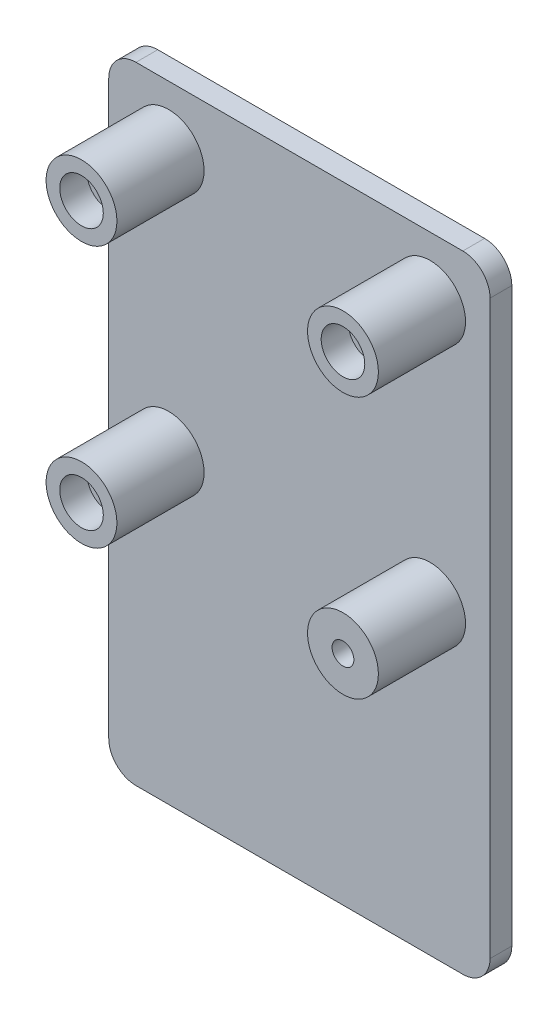
ISO-10303-21;
HEADER;
FILE_DESCRIPTION(('STEP AP214'),'2;1');
FILE_NAME('part.step','',(''),(''),'','','');
FILE_SCHEMA(('AUTOMOTIVE_DESIGN { 1 0 10303 214 1 1 1 1 }'));
ENDSEC;
DATA;
#1=APPLICATION_CONTEXT('core data for automotive mechanical design processes');
#2=APPLICATION_PROTOCOL_DEFINITION('international standard','automotive_design',2000,#1);
#3=PRODUCT_CONTEXT('',#1,'mechanical');
#4=PRODUCT('Part','Part','',(#3));
#5=PRODUCT_RELATED_PRODUCT_CATEGORY('part','',(#4));
#6=PRODUCT_DEFINITION_FORMATION('','',#4);
#7=PRODUCT_DEFINITION_CONTEXT('part definition',#1,'design');
#8=PRODUCT_DEFINITION('design','',#6,#7);
#9=PRODUCT_DEFINITION_SHAPE('','',#8);
#10=(LENGTH_UNIT() NAMED_UNIT(*) SI_UNIT(.MILLI.,.METRE.));
#11=(NAMED_UNIT(*) PLANE_ANGLE_UNIT() SI_UNIT($,.RADIAN.));
#12=(NAMED_UNIT(*) SI_UNIT($,.STERADIAN.) SOLID_ANGLE_UNIT());
#13=UNCERTAINTY_MEASURE_WITH_UNIT(LENGTH_MEASURE(1.E-05),#10,'distance_accuracy_value','');
#14=(GEOMETRIC_REPRESENTATION_CONTEXT(3) GLOBAL_UNCERTAINTY_ASSIGNED_CONTEXT((#13)) GLOBAL_UNIT_ASSIGNED_CONTEXT((#10,
#11,#12)) REPRESENTATION_CONTEXT('',''));
#15=CARTESIAN_POINT('',(0.,0.,0.));
#16=DIRECTION('',(0.,0.,1.));
#17=DIRECTION('',(1.,0.,0.));
#18=AXIS2_PLACEMENT_3D('',#15,#16,#17);
#19=CARTESIAN_POINT('',(-24.0000000000007,-23.9999999999995,20.));
#20=DIRECTION('',(0.,0.,-1.));
#21=DIRECTION('',(-1.,0.,0.));
#22=AXIS2_PLACEMENT_3D('',#19,#20,#21);
#23=CYLINDRICAL_SURFACE('',#22,1.99999999999961);
#24=CARTESIAN_POINT('',(-24.0000000000007,-23.9999999999995,0.));
#25=DIRECTION('',(0.,0.,1.));
#26=DIRECTION('',(1.,0.,0.));
#27=AXIS2_PLACEMENT_3D('',#24,#25,#26);
#28=CIRCLE('',#27,1.99999999999961);
#29=CARTESIAN_POINT('',(-22.0000000000011,-23.9999999999995,0.));
#30=VERTEX_POINT('',#29);
#31=EDGE_CURVE('E633',#30,#30,#28,.T.);
#32=ORIENTED_EDGE('',*,*,#31,.F.);
#33=EDGE_LOOP('',(#32));
#34=FACE_BOUND('',#33,.T.);
#35=CARTESIAN_POINT('',(-24.0000000000007,-23.9999999999995,15.));
#36=DIRECTION('',(0.,0.,1.));
#37=DIRECTION('',(1.,0.,0.));
#38=AXIS2_PLACEMENT_3D('',#35,#36,#37);
#39=CIRCLE('',#38,1.99999999999961);
#40=CARTESIAN_POINT('',(-22.0000000000011,-23.9999999999995,15.));
#41=VERTEX_POINT('',#40);
#42=EDGE_CURVE('E580',#41,#41,#39,.T.);
#43=ORIENTED_EDGE('',*,*,#42,.T.);
#44=EDGE_LOOP('',(#43));
#45=FACE_BOUND('',#44,.T.);
#46=ADVANCED_FACE('F63',(#34,#45),#23,.F.);
#47=CARTESIAN_POINT('',(24.,24.,20.));
#48=DIRECTION('',(0.,0.,-1.));
#49=DIRECTION('',(-1.,0.,0.));
#50=AXIS2_PLACEMENT_3D('',#47,#48,#49);
#51=CYLINDRICAL_SURFACE('',#50,2.00000000000001);
#52=CARTESIAN_POINT('',(24.,24.,0.));
#53=DIRECTION('',(0.,0.,1.));
#54=DIRECTION('',(1.,0.,0.));
#55=AXIS2_PLACEMENT_3D('',#52,#53,#54);
#56=CIRCLE('',#55,2.00000000000001);
#57=CARTESIAN_POINT('',(26.,24.,0.));
#58=VERTEX_POINT('',#57);
#59=EDGE_CURVE('E613',#58,#58,#56,.T.);
#60=ORIENTED_EDGE('',*,*,#59,.F.);
#61=EDGE_LOOP('',(#60));
#62=FACE_BOUND('',#61,.T.);
#63=CARTESIAN_POINT('',(24.,24.,15.));
#64=DIRECTION('',(0.,0.,1.));
#65=DIRECTION('',(1.,0.,0.));
#66=AXIS2_PLACEMENT_3D('',#63,#64,#65);
#67=CIRCLE('',#66,2.00000000000001);
#68=CARTESIAN_POINT('',(26.,24.,15.));
#69=VERTEX_POINT('',#68);
#70=EDGE_CURVE('E595',#69,#69,#67,.T.);
#71=ORIENTED_EDGE('',*,*,#70,.T.);
#72=EDGE_LOOP('',(#71));
#73=FACE_BOUND('',#72,.T.);
#74=ADVANCED_FACE('F226',(#62,#73),#51,.F.);
#75=CARTESIAN_POINT('',(-23.9999999999997,24.0000000000002,20.));
#76=DIRECTION('',(0.,0.,-1.));
#77=DIRECTION('',(-1.,0.,0.));
#78=AXIS2_PLACEMENT_3D('',#75,#76,#77);
#79=CYLINDRICAL_SURFACE('',#78,2.00000000000001);
#80=CARTESIAN_POINT('',(-23.9999999999997,24.0000000000002,0.));
#81=DIRECTION('',(0.,0.,1.));
#82=DIRECTION('',(1.,0.,0.));
#83=AXIS2_PLACEMENT_3D('',#80,#81,#82);
#84=CIRCLE('',#83,2.00000000000001);
#85=CARTESIAN_POINT('',(-21.9999999999997,24.0000000000002,0.));
#86=VERTEX_POINT('',#85);
#87=EDGE_CURVE('E605',#86,#86,#84,.T.);
#88=ORIENTED_EDGE('',*,*,#87,.F.);
#89=EDGE_LOOP('',(#88));
#90=FACE_BOUND('',#89,.T.);
#91=CARTESIAN_POINT('',(-23.9999999999997,24.0000000000002,15.));
#92=DIRECTION('',(0.,0.,1.));
#93=DIRECTION('',(1.,0.,0.));
#94=AXIS2_PLACEMENT_3D('',#91,#92,#93);
#95=CIRCLE('',#94,2.00000000000001);
#96=CARTESIAN_POINT('',(-21.9999999999997,24.0000000000002,15.));
#97=VERTEX_POINT('',#96);
#98=EDGE_CURVE('E600',#97,#97,#95,.T.);
#99=ORIENTED_EDGE('',*,*,#98,.T.);
#100=EDGE_LOOP('',(#99));
#101=FACE_BOUND('',#100,.T.);
#102=ADVANCED_FACE('F221',(#90,#101),#79,.F.);
#103=CARTESIAN_POINT('',(0.,35.0000000000003,4.));
#104=DIRECTION('',(0.,1.,0.));
#105=DIRECTION('',(-1.,0.,0.));
#106=AXIS2_PLACEMENT_3D('',#103,#104,#105);
#107=PLANE('',#106);
#108=DIRECTION('',(1.,0.,0.));
#109=VECTOR('',#108,1.);
#110=CARTESIAN_POINT('',(0.,35.0000000000003,0.));
#111=LINE('',#110,#109);
#112=CARTESIAN_POINT('',(-30.0000000000003,35.0000000000003,0.));
#113=VERTEX_POINT('',#112);
#114=CARTESIAN_POINT('',(29.9999999999997,35.0000000000003,0.));
#115=VERTEX_POINT('',#114);
#116=EDGE_CURVE('E162',#113,#115,#111,.T.);
#117=ORIENTED_EDGE('',*,*,#116,.F.);
#118=DIRECTION('',(0.,0.,-1.));
#119=VECTOR('',#118,1.);
#120=CARTESIAN_POINT('',(-30.0000000000003,35.0000000000003,4.));
#121=LINE('',#120,#119);
#122=CARTESIAN_POINT('',(-30.0000000000003,35.0000000000003,4.));
#123=VERTEX_POINT('',#122);
#124=EDGE_CURVE('E12',#123,#113,#121,.T.);
#125=ORIENTED_EDGE('',*,*,#124,.F.);
#126=DIRECTION('',(1.,0.,0.));
#127=VECTOR('',#126,1.);
#128=CARTESIAN_POINT('',(0.,35.0000000000003,4.));
#129=LINE('',#128,#127);
#130=CARTESIAN_POINT('',(29.9999999999997,35.0000000000003,4.));
#131=VERTEX_POINT('',#130);
#132=EDGE_CURVE('E658',#123,#131,#129,.T.);
#133=ORIENTED_EDGE('',*,*,#132,.T.);
#134=DIRECTION('',(0.,0.,-1.));
#135=VECTOR('',#134,1.);
#136=CARTESIAN_POINT('',(29.9999999999997,35.0000000000003,4.));
#137=LINE('',#136,#135);
#138=EDGE_CURVE('E81',#131,#115,#137,.T.);
#139=ORIENTED_EDGE('',*,*,#138,.T.);
#140=EDGE_LOOP('',(#117,#125,#133,#139));
#141=FACE_BOUND('',#140,.T.);
#142=ADVANCED_FACE('F65',(#141),#107,.T.);
#143=CARTESIAN_POINT('',(-30.0000000000003,30.0000000000003,4.));
#144=DIRECTION('',(0.,0.,-1.));
#145=DIRECTION('',(-1.,0.,0.));
#146=AXIS2_PLACEMENT_3D('',#143,#144,#145);
#147=CYLINDRICAL_SURFACE('',#146,5.00000000000001);
#148=CARTESIAN_POINT('',(-30.0000000000003,30.0000000000003,0.));
#149=DIRECTION('',(0.,0.,1.));
#150=DIRECTION('',(1.,0.,0.));
#151=AXIS2_PLACEMENT_3D('',#148,#149,#150);
#152=CIRCLE('',#151,5.00000000000001);
#153=CARTESIAN_POINT('',(-35.0000000000003,30.0000000000003,0.));
#154=VERTEX_POINT('',#153);
#155=EDGE_CURVE('E165',#113,#154,#152,.T.);
#156=ORIENTED_EDGE('',*,*,#155,.T.);
#157=DIRECTION('',(0.,0.,-1.));
#158=VECTOR('',#157,1.);
#159=CARTESIAN_POINT('',(-35.0000000000003,30.0000000000003,4.));
#160=LINE('',#159,#158);
#161=CARTESIAN_POINT('',(-35.0000000000003,30.0000000000003,4.));
#162=VERTEX_POINT('',#161);
#163=EDGE_CURVE('E73',#162,#154,#160,.T.);
#164=ORIENTED_EDGE('',*,*,#163,.F.);
#165=CARTESIAN_POINT('',(-30.0000000000003,30.0000000000003,4.));
#166=DIRECTION('',(0.,0.,1.));
#167=DIRECTION('',(1.,0.,0.));
#168=AXIS2_PLACEMENT_3D('',#165,#166,#167);
#169=CIRCLE('',#168,5.00000000000001);
#170=EDGE_CURVE('E661',#123,#162,#169,.T.);
#171=ORIENTED_EDGE('',*,*,#170,.F.);
#172=ORIENTED_EDGE('',*,*,#124,.T.);
#173=EDGE_LOOP('',(#156,#164,#171,#172));
#174=FACE_BOUND('',#173,.T.);
#175=ADVANCED_FACE('F216',(#174),#147,.T.);
#176=CARTESIAN_POINT('',(-35.0000000000003,0.,4.));
#177=DIRECTION('',(1.,0.,0.));
#178=DIRECTION('',(0.,1.,0.));
#179=AXIS2_PLACEMENT_3D('',#176,#177,#178);
#180=PLANE('',#179);
#181=DIRECTION('',(0.,-1.,0.));
#182=VECTOR('',#181,1.);
#183=CARTESIAN_POINT('',(-35.0000000000003,0.,0.));
#184=LINE('',#183,#182);
#185=CARTESIAN_POINT('',(-35.0000000000003,-74.9999999999997,0.));
#186=VERTEX_POINT('',#185);
#187=EDGE_CURVE('E170',#154,#186,#184,.T.);
#188=ORIENTED_EDGE('',*,*,#187,.T.);
#189=DIRECTION('',(0.,0.,-1.));
#190=VECTOR('',#189,1.);
#191=CARTESIAN_POINT('',(-35.0000000000003,-74.9999999999997,4.));
#192=LINE('',#191,#190);
#193=CARTESIAN_POINT('',(-35.0000000000003,-74.9999999999997,4.));
#194=VERTEX_POINT('',#193);
#195=EDGE_CURVE('E202',#194,#186,#192,.T.);
#196=ORIENTED_EDGE('',*,*,#195,.F.);
#197=DIRECTION('',(0.,-1.,0.));
#198=VECTOR('',#197,1.);
#199=CARTESIAN_POINT('',(-35.0000000000003,0.,4.));
#200=LINE('',#199,#198);
#201=EDGE_CURVE('E212',#162,#194,#200,.T.);
#202=ORIENTED_EDGE('',*,*,#201,.F.);
#203=ORIENTED_EDGE('',*,*,#163,.T.);
#204=EDGE_LOOP('',(#188,#196,#202,#203));
#205=FACE_BOUND('',#204,.T.);
#206=ADVANCED_FACE('F209',(#205),#180,.F.);
#207=CARTESIAN_POINT('',(-30.0000000000003,-74.9999999999997,4.));
#208=DIRECTION('',(0.,0.,-1.));
#209=DIRECTION('',(-1.,0.,0.));
#210=AXIS2_PLACEMENT_3D('',#207,#208,#209);
#211=CYLINDRICAL_SURFACE('',#210,5.);
#212=CARTESIAN_POINT('',(-30.0000000000003,-74.9999999999997,0.));
#213=DIRECTION('',(0.,0.,1.));
#214=DIRECTION('',(1.,0.,0.));
#215=AXIS2_PLACEMENT_3D('',#212,#213,#214);
#216=CIRCLE('',#215,5.);
#217=CARTESIAN_POINT('',(-30.0000000000003,-79.9999999999997,0.));
#218=VERTEX_POINT('',#217);
#219=EDGE_CURVE('E174',#186,#218,#216,.T.);
#220=ORIENTED_EDGE('',*,*,#219,.T.);
#221=DIRECTION('',(0.,0.,-1.));
#222=VECTOR('',#221,1.);
#223=CARTESIAN_POINT('',(-30.0000000000003,-79.9999999999997,4.));
#224=LINE('',#223,#222);
#225=CARTESIAN_POINT('',(-30.0000000000003,-79.9999999999997,4.));
#226=VERTEX_POINT('',#225);
#227=EDGE_CURVE('E198',#226,#218,#224,.T.);
#228=ORIENTED_EDGE('',*,*,#227,.F.);
#229=CARTESIAN_POINT('',(-30.0000000000003,-74.9999999999997,4.));
#230=DIRECTION('',(0.,0.,1.));
#231=DIRECTION('',(1.,0.,0.));
#232=AXIS2_PLACEMENT_3D('',#229,#230,#231);
#233=CIRCLE('',#232,5.);
#234=EDGE_CURVE('E666',#194,#226,#233,.T.);
#235=ORIENTED_EDGE('',*,*,#234,.F.);
#236=ORIENTED_EDGE('',*,*,#195,.T.);
#237=EDGE_LOOP('',(#220,#228,#235,#236));
#238=FACE_BOUND('',#237,.T.);
#239=ADVANCED_FACE('F262',(#238),#211,.T.);
#240=CARTESIAN_POINT('',(0.,-79.9999999999997,4.));
#241=DIRECTION('',(0.,1.,0.));
#242=DIRECTION('',(-1.,0.,0.));
#243=AXIS2_PLACEMENT_3D('',#240,#241,#242);
#244=PLANE('',#243);
#245=DIRECTION('',(1.,0.,0.));
#246=VECTOR('',#245,1.);
#247=CARTESIAN_POINT('',(0.,-79.9999999999997,0.));
#248=LINE('',#247,#246);
#249=CARTESIAN_POINT('',(29.9999999999997,-79.9999999999997,0.));
#250=VERTEX_POINT('',#249);
#251=EDGE_CURVE('E178',#218,#250,#248,.T.);
#252=ORIENTED_EDGE('',*,*,#251,.T.);
#253=DIRECTION('',(0.,0.,-1.));
#254=VECTOR('',#253,1.);
#255=CARTESIAN_POINT('',(29.9999999999997,-79.9999999999997,4.));
#256=LINE('',#255,#254);
#257=CARTESIAN_POINT('',(29.9999999999997,-79.9999999999997,4.));
#258=VERTEX_POINT('',#257);
#259=EDGE_CURVE('E152',#258,#250,#256,.T.);
#260=ORIENTED_EDGE('',*,*,#259,.F.);
#261=DIRECTION('',(1.,0.,0.));
#262=VECTOR('',#261,1.);
#263=CARTESIAN_POINT('',(0.,-79.9999999999997,4.));
#264=LINE('',#263,#262);
#265=EDGE_CURVE('E139',#226,#258,#264,.T.);
#266=ORIENTED_EDGE('',*,*,#265,.F.);
#267=ORIENTED_EDGE('',*,*,#227,.T.);
#268=EDGE_LOOP('',(#252,#260,#266,#267));
#269=FACE_BOUND('',#268,.T.);
#270=ADVANCED_FACE('F259',(#269),#244,.F.);
#271=CARTESIAN_POINT('',(29.9999999999997,-74.9999999999997,4.));
#272=DIRECTION('',(0.,0.,-1.));
#273=DIRECTION('',(-1.,0.,0.));
#274=AXIS2_PLACEMENT_3D('',#271,#272,#273);
#275=CYLINDRICAL_SURFACE('',#274,5.);
#276=CARTESIAN_POINT('',(29.9999999999997,-74.9999999999997,0.));
#277=DIRECTION('',(0.,0.,1.));
#278=DIRECTION('',(1.,0.,0.));
#279=AXIS2_PLACEMENT_3D('',#276,#277,#278);
#280=CIRCLE('',#279,5.);
#281=CARTESIAN_POINT('',(34.9999999999997,-74.9999999999997,0.));
#282=VERTEX_POINT('',#281);
#283=EDGE_CURVE('E148',#250,#282,#280,.T.);
#284=ORIENTED_EDGE('',*,*,#283,.T.);
#285=DIRECTION('',(0.,0.,-1.));
#286=VECTOR('',#285,1.);
#287=CARTESIAN_POINT('',(34.9999999999997,-74.9999999999997,4.));
#288=LINE('',#287,#286);
#289=CARTESIAN_POINT('',(34.9999999999997,-74.9999999999997,4.));
#290=VERTEX_POINT('',#289);
#291=EDGE_CURVE('E146',#290,#282,#288,.T.);
#292=ORIENTED_EDGE('',*,*,#291,.F.);
#293=CARTESIAN_POINT('',(29.9999999999997,-74.9999999999997,4.));
#294=DIRECTION('',(0.,0.,1.));
#295=DIRECTION('',(1.,0.,0.));
#296=AXIS2_PLACEMENT_3D('',#293,#294,#295);
#297=CIRCLE('',#296,5.);
#298=EDGE_CURVE('E131',#258,#290,#297,.T.);
#299=ORIENTED_EDGE('',*,*,#298,.F.);
#300=ORIENTED_EDGE('',*,*,#259,.T.);
#301=EDGE_LOOP('',(#284,#292,#299,#300));
#302=FACE_BOUND('',#301,.T.);
#303=ADVANCED_FACE('F147',(#302),#275,.T.);
#304=CARTESIAN_POINT('',(34.9999999999997,0.,4.));
#305=DIRECTION('',(1.,0.,0.));
#306=DIRECTION('',(0.,1.,0.));
#307=AXIS2_PLACEMENT_3D('',#304,#305,#306);
#308=PLANE('',#307);
#309=DIRECTION('',(0.,-1.,0.));
#310=VECTOR('',#309,1.);
#311=CARTESIAN_POINT('',(34.9999999999997,0.,0.));
#312=LINE('',#311,#310);
#313=CARTESIAN_POINT('',(34.9999999999997,30.0000000000003,0.));
#314=VERTEX_POINT('',#313);
#315=EDGE_CURVE('E184',#314,#282,#312,.T.);
#316=ORIENTED_EDGE('',*,*,#315,.F.);
#317=DIRECTION('',(0.,0.,-1.));
#318=VECTOR('',#317,1.);
#319=CARTESIAN_POINT('',(34.9999999999997,30.0000000000003,4.));
#320=LINE('',#319,#318);
#321=CARTESIAN_POINT('',(34.9999999999997,30.0000000000003,4.));
#322=VERTEX_POINT('',#321);
#323=EDGE_CURVE('E106',#322,#314,#320,.T.);
#324=ORIENTED_EDGE('',*,*,#323,.F.);
#325=DIRECTION('',(0.,-1.,0.));
#326=VECTOR('',#325,1.);
#327=CARTESIAN_POINT('',(34.9999999999997,0.,4.));
#328=LINE('',#327,#326);
#329=EDGE_CURVE('E137',#322,#290,#328,.T.);
#330=ORIENTED_EDGE('',*,*,#329,.T.);
#331=ORIENTED_EDGE('',*,*,#291,.T.);
#332=EDGE_LOOP('',(#316,#324,#330,#331));
#333=FACE_BOUND('',#332,.T.);
#334=ADVANCED_FACE('F154',(#333),#308,.T.);
#335=CARTESIAN_POINT('',(29.9999999999997,30.0000000000003,4.));
#336=DIRECTION('',(0.,0.,-1.));
#337=DIRECTION('',(-1.,0.,0.));
#338=AXIS2_PLACEMENT_3D('',#335,#336,#337);
#339=CYLINDRICAL_SURFACE('',#338,5.);
#340=CARTESIAN_POINT('',(29.9999999999997,30.0000000000003,0.));
#341=DIRECTION('',(0.,0.,1.));
#342=DIRECTION('',(1.,0.,0.));
#343=AXIS2_PLACEMENT_3D('',#340,#341,#342);
#344=CIRCLE('',#343,5.);
#345=EDGE_CURVE('E187',#115,#314,#344,.F.);
#346=ORIENTED_EDGE('',*,*,#345,.F.);
#347=ORIENTED_EDGE('',*,*,#138,.F.);
#348=CARTESIAN_POINT('',(29.9999999999997,30.0000000000003,4.));
#349=DIRECTION('',(0.,0.,1.));
#350=DIRECTION('',(1.,0.,0.));
#351=AXIS2_PLACEMENT_3D('',#348,#349,#350);
#352=CIRCLE('',#351,5.);
#353=EDGE_CURVE('E156',#131,#322,#352,.F.);
#354=ORIENTED_EDGE('',*,*,#353,.T.);
#355=ORIENTED_EDGE('',*,*,#323,.T.);
#356=EDGE_LOOP('',(#346,#347,#354,#355));
#357=FACE_BOUND('',#356,.T.);
#358=ADVANCED_FACE('F249',(#357),#339,.T.);
#359=CARTESIAN_POINT('',(0.,0.,4.));
#360=DIRECTION('',(0.,0.,1.));
#361=DIRECTION('',(1.,0.,0.));
#362=AXIS2_PLACEMENT_3D('',#359,#360,#361);
#363=PLANE('',#362);
#364=CARTESIAN_POINT('',(23.9999999999999,-24.0000000000001,4.));
#365=DIRECTION('',(0.,0.,1.));
#366=DIRECTION('',(1.,0.,0.));
#367=AXIS2_PLACEMENT_3D('',#364,#365,#366);
#368=CIRCLE('',#367,6.50000000000001);
#369=CARTESIAN_POINT('',(30.4999999999999,-24.0000000000001,4.));
#370=VERTEX_POINT('',#369);
#371=EDGE_CURVE('E191',#370,#370,#368,.T.);
#372=ORIENTED_EDGE('',*,*,#371,.F.);
#373=EDGE_LOOP('',(#372));
#374=FACE_BOUND('',#373,.T.);
#375=CARTESIAN_POINT('',(24.,24.,4.));
#376=DIRECTION('',(0.,0.,1.));
#377=DIRECTION('',(1.,0.,0.));
#378=AXIS2_PLACEMENT_3D('',#375,#376,#377);
#379=CIRCLE('',#378,6.50000000000001);
#380=CARTESIAN_POINT('',(30.5,24.,4.));
#381=VERTEX_POINT('',#380);
#382=EDGE_CURVE('E646',#381,#381,#379,.T.);
#383=ORIENTED_EDGE('',*,*,#382,.F.);
#384=EDGE_LOOP('',(#383));
#385=FACE_BOUND('',#384,.T.);
#386=CARTESIAN_POINT('',(-23.9999999999997,24.0000000000002,4.));
#387=DIRECTION('',(0.,0.,1.));
#388=DIRECTION('',(1.,0.,0.));
#389=AXIS2_PLACEMENT_3D('',#386,#387,#388);
#390=CIRCLE('',#389,6.50000000000001);
#391=CARTESIAN_POINT('',(-17.4999999999997,24.0000000000002,4.));
#392=VERTEX_POINT('',#391);
#393=EDGE_CURVE('E650',#392,#392,#390,.T.);
#394=ORIENTED_EDGE('',*,*,#393,.F.);
#395=EDGE_LOOP('',(#394));
#396=FACE_BOUND('',#395,.T.);
#397=CARTESIAN_POINT('',(-24.0000000000007,-23.9999999999995,4.));
#398=DIRECTION('',(0.,0.,1.));
#399=DIRECTION('',(1.,0.,0.));
#400=AXIS2_PLACEMENT_3D('',#397,#398,#399);
#401=CIRCLE('',#400,6.50000000000001);
#402=CARTESIAN_POINT('',(-17.5000000000007,-23.9999999999995,4.));
#403=VERTEX_POINT('',#402);
#404=EDGE_CURVE('E654',#403,#403,#401,.T.);
#405=ORIENTED_EDGE('',*,*,#404,.F.);
#406=EDGE_LOOP('',(#405));
#407=FACE_BOUND('',#406,.T.);
#408=ORIENTED_EDGE('',*,*,#132,.F.);
#409=ORIENTED_EDGE('',*,*,#170,.T.);
#410=ORIENTED_EDGE('',*,*,#201,.T.);
#411=ORIENTED_EDGE('',*,*,#234,.T.);
#412=ORIENTED_EDGE('',*,*,#265,.T.);
#413=ORIENTED_EDGE('',*,*,#298,.T.);
#414=ORIENTED_EDGE('',*,*,#329,.F.);
#415=ORIENTED_EDGE('',*,*,#353,.F.);
#416=EDGE_LOOP('',(#408,#409,#410,#411,#412,#413,#414,#415));
#417=FACE_BOUND('',#416,.T.);
#418=ADVANCED_FACE('F134',(#374,#385,#396,#407,#417),#363,.T.);
#419=CARTESIAN_POINT('',(0.,0.,0.));
#420=DIRECTION('',(0.,0.,1.));
#421=DIRECTION('',(1.,0.,0.));
#422=AXIS2_PLACEMENT_3D('',#419,#420,#421);
#423=PLANE('',#422);
#424=ORIENTED_EDGE('',*,*,#116,.T.);
#425=ORIENTED_EDGE('',*,*,#345,.T.);
#426=ORIENTED_EDGE('',*,*,#315,.T.);
#427=ORIENTED_EDGE('',*,*,#283,.F.);
#428=ORIENTED_EDGE('',*,*,#251,.F.);
#429=ORIENTED_EDGE('',*,*,#219,.F.);
#430=ORIENTED_EDGE('',*,*,#187,.F.);
#431=ORIENTED_EDGE('',*,*,#155,.F.);
#432=EDGE_LOOP('',(#424,#425,#426,#427,#428,#429,#430,#431));
#433=FACE_BOUND('',#432,.T.);
#434=ORIENTED_EDGE('',*,*,#31,.T.);
#435=EDGE_LOOP('',(#434));
#436=FACE_BOUND('',#435,.T.);
#437=CARTESIAN_POINT('',(23.9999999999999,-24.0000000000001,0.));
#438=DIRECTION('',(0.,0.,1.));
#439=DIRECTION('',(1.,0.,0.));
#440=AXIS2_PLACEMENT_3D('',#437,#438,#439);
#441=CIRCLE('',#440,2.00000000000001);
#442=CARTESIAN_POINT('',(25.9999999999999,-24.0000000000001,0.));
#443=VERTEX_POINT('',#442);
#444=EDGE_CURVE('E621',#443,#443,#441,.T.);
#445=ORIENTED_EDGE('',*,*,#444,.T.);
#446=EDGE_LOOP('',(#445));
#447=FACE_BOUND('',#446,.T.);
#448=ORIENTED_EDGE('',*,*,#59,.T.);
#449=EDGE_LOOP('',(#448));
#450=FACE_BOUND('',#449,.T.);
#451=ORIENTED_EDGE('',*,*,#87,.T.);
#452=EDGE_LOOP('',(#451));
#453=FACE_BOUND('',#452,.T.);
#454=ADVANCED_FACE('F218',(#433,#436,#447,#450,#453),#423,.F.);
#455=CARTESIAN_POINT('',(-24.0000000000007,-23.9999999999995,20.));
#456=DIRECTION('',(0.,0.,-1.));
#457=DIRECTION('',(-1.,0.,0.));
#458=AXIS2_PLACEMENT_3D('',#455,#456,#457);
#459=CYLINDRICAL_SURFACE('',#458,6.50000000000001);
#460=ORIENTED_EDGE('',*,*,#404,.T.);
#461=EDGE_LOOP('',(#460));
#462=FACE_BOUND('',#461,.T.);
#463=CARTESIAN_POINT('',(-24.0000000000007,-23.9999999999995,20.));
#464=DIRECTION('',(0.,0.,1.));
#465=DIRECTION('',(1.,0.,0.));
#466=AXIS2_PLACEMENT_3D('',#463,#464,#465);
#467=CIRCLE('',#466,6.50000000000001);
#468=CARTESIAN_POINT('',(-17.5000000000007,-23.9999999999995,20.));
#469=VERTEX_POINT('',#468);
#470=EDGE_CURVE('E166',#469,#469,#467,.T.);
#471=ORIENTED_EDGE('',*,*,#470,.F.);
#472=EDGE_LOOP('',(#471));
#473=FACE_BOUND('',#472,.T.);
#474=ADVANCED_FACE('F243',(#462,#473),#459,.T.);
#475=CARTESIAN_POINT('',(0.,0.,20.));
#476=DIRECTION('',(0.,0.,1.));
#477=DIRECTION('',(1.,0.,0.));
#478=AXIS2_PLACEMENT_3D('',#475,#476,#477);
#479=PLANE('',#478);
#480=CARTESIAN_POINT('',(-24.0000000000007,-23.9999999999995,20.));
#481=DIRECTION('',(0.,0.,1.));
#482=DIRECTION('',(1.,0.,0.));
#483=AXIS2_PLACEMENT_3D('',#480,#481,#482);
#484=CIRCLE('',#483,3.99999999999961);
#485=CARTESIAN_POINT('',(-20.0000000000011,-23.9999999999995,20.));
#486=VERTEX_POINT('',#485);
#487=EDGE_CURVE('E585',#486,#486,#484,.T.);
#488=ORIENTED_EDGE('',*,*,#487,.F.);
#489=EDGE_LOOP('',(#488));
#490=FACE_BOUND('',#489,.T.);
#491=ORIENTED_EDGE('',*,*,#470,.T.);
#492=EDGE_LOOP('',(#491));
#493=FACE_BOUND('',#492,.T.);
#494=ADVANCED_FACE('F241',(#490,#493),#479,.T.);
#495=CARTESIAN_POINT('',(23.9999999999999,-24.0000000000001,20.));
#496=DIRECTION('',(0.,0.,-1.));
#497=DIRECTION('',(-1.,0.,0.));
#498=AXIS2_PLACEMENT_3D('',#495,#496,#497);
#499=CYLINDRICAL_SURFACE('',#498,6.50000000000001);
#500=ORIENTED_EDGE('',*,*,#371,.T.);
#501=EDGE_LOOP('',(#500));
#502=FACE_BOUND('',#501,.T.);
#503=CARTESIAN_POINT('',(23.9999999999999,-24.0000000000001,20.));
#504=DIRECTION('',(0.,0.,1.));
#505=DIRECTION('',(1.,0.,0.));
#506=AXIS2_PLACEMENT_3D('',#503,#504,#505);
#507=CIRCLE('',#506,6.50000000000001);
#508=CARTESIAN_POINT('',(30.4999999999999,-24.0000000000001,20.));
#509=VERTEX_POINT('',#508);
#510=EDGE_CURVE('E625',#509,#509,#507,.T.);
#511=ORIENTED_EDGE('',*,*,#510,.F.);
#512=EDGE_LOOP('',(#511));
#513=FACE_BOUND('',#512,.T.);
#514=ADVANCED_FACE('F311',(#502,#513),#499,.T.);
#515=CARTESIAN_POINT('',(23.9999999999999,-24.0000000000001,20.));
#516=DIRECTION('',(0.,0.,-1.));
#517=DIRECTION('',(-1.,0.,0.));
#518=AXIS2_PLACEMENT_3D('',#515,#516,#517);
#519=CYLINDRICAL_SURFACE('',#518,2.00000000000001);
#520=CARTESIAN_POINT('',(23.9999999999999,-24.0000000000001,20.));
#521=DIRECTION('',(0.,0.,1.));
#522=DIRECTION('',(1.,0.,0.));
#523=AXIS2_PLACEMENT_3D('',#520,#521,#522);
#524=CIRCLE('',#523,2.00000000000001);
#525=CARTESIAN_POINT('',(25.9999999999999,-24.0000000000001,20.));
#526=VERTEX_POINT('',#525);
#527=EDGE_CURVE('E629',#526,#526,#524,.T.);
#528=ORIENTED_EDGE('',*,*,#527,.T.);
#529=EDGE_LOOP('',(#528));
#530=FACE_BOUND('',#529,.T.);
#531=ORIENTED_EDGE('',*,*,#444,.F.);
#532=EDGE_LOOP('',(#531));
#533=FACE_BOUND('',#532,.T.);
#534=ADVANCED_FACE('F319',(#530,#533),#519,.F.);
#535=CARTESIAN_POINT('',(0.,0.,20.));
#536=DIRECTION('',(0.,0.,1.));
#537=DIRECTION('',(1.,0.,0.));
#538=AXIS2_PLACEMENT_3D('',#535,#536,#537);
#539=PLANE('',#538);
#540=ORIENTED_EDGE('',*,*,#510,.T.);
#541=EDGE_LOOP('',(#540));
#542=FACE_BOUND('',#541,.T.);
#543=ORIENTED_EDGE('',*,*,#527,.F.);
#544=EDGE_LOOP('',(#543));
#545=FACE_BOUND('',#544,.T.);
#546=ADVANCED_FACE('F326',(#542,#545),#539,.T.);
#547=CARTESIAN_POINT('',(24.,24.,20.));
#548=DIRECTION('',(0.,0.,-1.));
#549=DIRECTION('',(-1.,0.,0.));
#550=AXIS2_PLACEMENT_3D('',#547,#548,#549);
#551=CYLINDRICAL_SURFACE('',#550,6.50000000000001);
#552=ORIENTED_EDGE('',*,*,#382,.T.);
#553=EDGE_LOOP('',(#552));
#554=FACE_BOUND('',#553,.T.);
#555=CARTESIAN_POINT('',(24.,24.,20.));
#556=DIRECTION('',(0.,0.,1.));
#557=DIRECTION('',(1.,0.,0.));
#558=AXIS2_PLACEMENT_3D('',#555,#556,#557);
#559=CIRCLE('',#558,6.50000000000001);
#560=CARTESIAN_POINT('',(30.5,24.,20.));
#561=VERTEX_POINT('',#560);
#562=EDGE_CURVE('E617',#561,#561,#559,.T.);
#563=ORIENTED_EDGE('',*,*,#562,.F.);
#564=EDGE_LOOP('',(#563));
#565=FACE_BOUND('',#564,.T.);
#566=ADVANCED_FACE('F334',(#554,#565),#551,.T.);
#567=CARTESIAN_POINT('',(0.,0.,20.));
#568=DIRECTION('',(0.,0.,1.));
#569=DIRECTION('',(1.,0.,0.));
#570=AXIS2_PLACEMENT_3D('',#567,#568,#569);
#571=PLANE('',#570);
#572=CARTESIAN_POINT('',(24.,24.,20.));
#573=DIRECTION('',(0.,0.,1.));
#574=DIRECTION('',(1.,0.,0.));
#575=AXIS2_PLACEMENT_3D('',#572,#573,#574);
#576=CIRCLE('',#575,4.00000000000001);
#577=CARTESIAN_POINT('',(28.,24.,20.));
#578=VERTEX_POINT('',#577);
#579=EDGE_CURVE('E599',#578,#578,#576,.T.);
#580=ORIENTED_EDGE('',*,*,#579,.F.);
#581=EDGE_LOOP('',(#580));
#582=FACE_BOUND('',#581,.T.);
#583=ORIENTED_EDGE('',*,*,#562,.T.);
#584=EDGE_LOOP('',(#583));
#585=FACE_BOUND('',#584,.T.);
#586=ADVANCED_FACE('F342',(#582,#585),#571,.T.);
#587=CARTESIAN_POINT('',(-23.9999999999997,24.0000000000002,20.));
#588=DIRECTION('',(0.,0.,-1.));
#589=DIRECTION('',(-1.,0.,0.));
#590=AXIS2_PLACEMENT_3D('',#587,#588,#589);
#591=CYLINDRICAL_SURFACE('',#590,6.50000000000001);
#592=ORIENTED_EDGE('',*,*,#393,.T.);
#593=EDGE_LOOP('',(#592));
#594=FACE_BOUND('',#593,.T.);
#595=CARTESIAN_POINT('',(-23.9999999999997,24.0000000000002,20.));
#596=DIRECTION('',(0.,0.,1.));
#597=DIRECTION('',(1.,0.,0.));
#598=AXIS2_PLACEMENT_3D('',#595,#596,#597);
#599=CIRCLE('',#598,6.50000000000001);
#600=CARTESIAN_POINT('',(-17.4999999999997,24.0000000000002,20.));
#601=VERTEX_POINT('',#600);
#602=EDGE_CURVE('E609',#601,#601,#599,.T.);
#603=ORIENTED_EDGE('',*,*,#602,.F.);
#604=EDGE_LOOP('',(#603));
#605=FACE_BOUND('',#604,.T.);
#606=ADVANCED_FACE('F350',(#594,#605),#591,.T.);
#607=CARTESIAN_POINT('',(0.,0.,20.));
#608=DIRECTION('',(0.,0.,1.));
#609=DIRECTION('',(1.,0.,0.));
#610=AXIS2_PLACEMENT_3D('',#607,#608,#609);
#611=PLANE('',#610);
#612=CARTESIAN_POINT('',(-23.9999999999997,24.0000000000002,20.));
#613=DIRECTION('',(0.,0.,1.));
#614=DIRECTION('',(1.,0.,0.));
#615=AXIS2_PLACEMENT_3D('',#612,#613,#614);
#616=CIRCLE('',#615,4.00000000000001);
#617=CARTESIAN_POINT('',(-19.9999999999997,24.0000000000002,20.));
#618=VERTEX_POINT('',#617);
#619=EDGE_CURVE('E672',#618,#618,#616,.T.);
#620=ORIENTED_EDGE('',*,*,#619,.F.);
#621=EDGE_LOOP('',(#620));
#622=FACE_BOUND('',#621,.T.);
#623=ORIENTED_EDGE('',*,*,#602,.T.);
#624=EDGE_LOOP('',(#623));
#625=FACE_BOUND('',#624,.T.);
#626=ADVANCED_FACE('F358',(#622,#625),#611,.T.);
#627=CARTESIAN_POINT('',(-23.9999999999997,24.0000000000002,15.));
#628=DIRECTION('',(0.,0.,1.));
#629=DIRECTION('',(1.,0.,0.));
#630=AXIS2_PLACEMENT_3D('',#627,#628,#629);
#631=CYLINDRICAL_SURFACE('',#630,4.00000000000001);
#632=CARTESIAN_POINT('',(-23.9999999999997,24.0000000000002,15.));
#633=DIRECTION('',(0.,0.,1.));
#634=DIRECTION('',(1.,0.,0.));
#635=AXIS2_PLACEMENT_3D('',#632,#633,#634);
#636=CIRCLE('',#635,4.00000000000001);
#637=CARTESIAN_POINT('',(-19.9999999999997,24.0000000000002,15.));
#638=VERTEX_POINT('',#637);
#639=EDGE_CURVE('E594',#638,#638,#636,.T.);
#640=ORIENTED_EDGE('',*,*,#639,.F.);
#641=EDGE_LOOP('',(#640));
#642=FACE_BOUND('',#641,.T.);
#643=ORIENTED_EDGE('',*,*,#619,.T.);
#644=EDGE_LOOP('',(#643));
#645=FACE_BOUND('',#644,.T.);
#646=ADVANCED_FACE('F365',(#642,#645),#631,.F.);
#647=CARTESIAN_POINT('',(-23.9999999999997,24.0000000000002,15.));
#648=DIRECTION('',(0.,0.,1.));
#649=DIRECTION('',(1.,0.,0.));
#650=AXIS2_PLACEMENT_3D('',#647,#648,#649);
#651=PLANE('',#650);
#652=ORIENTED_EDGE('',*,*,#98,.F.);
#653=EDGE_LOOP('',(#652));
#654=FACE_BOUND('',#653,.T.);
#655=ORIENTED_EDGE('',*,*,#639,.T.);
#656=EDGE_LOOP('',(#655));
#657=FACE_BOUND('',#656,.T.);
#658=ADVANCED_FACE('F373',(#654,#657),#651,.T.);
#659=CARTESIAN_POINT('',(24.,24.,15.));
#660=DIRECTION('',(0.,0.,1.));
#661=DIRECTION('',(1.,0.,0.));
#662=AXIS2_PLACEMENT_3D('',#659,#660,#661);
#663=CYLINDRICAL_SURFACE('',#662,4.00000000000001);
#664=CARTESIAN_POINT('',(24.,24.,15.));
#665=DIRECTION('',(0.,0.,1.));
#666=DIRECTION('',(1.,0.,0.));
#667=AXIS2_PLACEMENT_3D('',#664,#665,#666);
#668=CIRCLE('',#667,4.00000000000001);
#669=CARTESIAN_POINT('',(28.,24.,15.));
#670=VERTEX_POINT('',#669);
#671=EDGE_CURVE('E601',#670,#670,#668,.T.);
#672=ORIENTED_EDGE('',*,*,#671,.F.);
#673=EDGE_LOOP('',(#672));
#674=FACE_BOUND('',#673,.T.);
#675=ORIENTED_EDGE('',*,*,#579,.T.);
#676=EDGE_LOOP('',(#675));
#677=FACE_BOUND('',#676,.T.);
#678=ADVANCED_FACE('F381',(#674,#677),#663,.F.);
#679=CARTESIAN_POINT('',(24.,24.,15.));
#680=DIRECTION('',(0.,0.,1.));
#681=DIRECTION('',(1.,0.,0.));
#682=AXIS2_PLACEMENT_3D('',#679,#680,#681);
#683=PLANE('',#682);
#684=ORIENTED_EDGE('',*,*,#70,.F.);
#685=EDGE_LOOP('',(#684));
#686=FACE_BOUND('',#685,.T.);
#687=ORIENTED_EDGE('',*,*,#671,.T.);
#688=EDGE_LOOP('',(#687));
#689=FACE_BOUND('',#688,.T.);
#690=ADVANCED_FACE('F389',(#686,#689),#683,.T.);
#691=CARTESIAN_POINT('',(-24.0000000000007,-23.9999999999995,15.));
#692=DIRECTION('',(0.,0.,1.));
#693=DIRECTION('',(1.,0.,0.));
#694=AXIS2_PLACEMENT_3D('',#691,#692,#693);
#695=CYLINDRICAL_SURFACE('',#694,3.99999999999961);
#696=CARTESIAN_POINT('',(-24.0000000000007,-23.9999999999995,15.));
#697=DIRECTION('',(0.,0.,1.));
#698=DIRECTION('',(1.,0.,0.));
#699=AXIS2_PLACEMENT_3D('',#696,#697,#698);
#700=CIRCLE('',#699,3.99999999999961);
#701=CARTESIAN_POINT('',(-20.0000000000011,-23.9999999999995,15.));
#702=VERTEX_POINT('',#701);
#703=EDGE_CURVE('E583',#702,#702,#700,.T.);
#704=ORIENTED_EDGE('',*,*,#703,.F.);
#705=EDGE_LOOP('',(#704));
#706=FACE_BOUND('',#705,.T.);
#707=ORIENTED_EDGE('',*,*,#487,.T.);
#708=EDGE_LOOP('',(#707));
#709=FACE_BOUND('',#708,.T.);
#710=ADVANCED_FACE('F397',(#706,#709),#695,.F.);
#711=CARTESIAN_POINT('',(-24.0000000000007,-23.9999999999995,15.));
#712=DIRECTION('',(0.,0.,1.));
#713=DIRECTION('',(1.,0.,0.));
#714=AXIS2_PLACEMENT_3D('',#711,#712,#713);
#715=PLANE('',#714);
#716=ORIENTED_EDGE('',*,*,#42,.F.);
#717=EDGE_LOOP('',(#716));
#718=FACE_BOUND('',#717,.T.);
#719=ORIENTED_EDGE('',*,*,#703,.T.);
#720=EDGE_LOOP('',(#719));
#721=FACE_BOUND('',#720,.T.);
#722=ADVANCED_FACE('F405',(#718,#721),#715,.T.);
#723=CLOSED_SHELL('',(#46,#74,#102,#142,#175,#206,#239,#270,#303,#334,#358,#418,#454,#474,#494,
#514,#534,#546,#566,#586,#606,#626,#646,#658,#678,#690,#710,#722));
#724=MANIFOLD_SOLID_BREP('B2',#723);
#725=ADVANCED_BREP_SHAPE_REPRESENTATION('',(#18,#724),#14);
#726=SHAPE_DEFINITION_REPRESENTATION(#9,#725);
ENDSEC;
END-ISO-10303-21;
